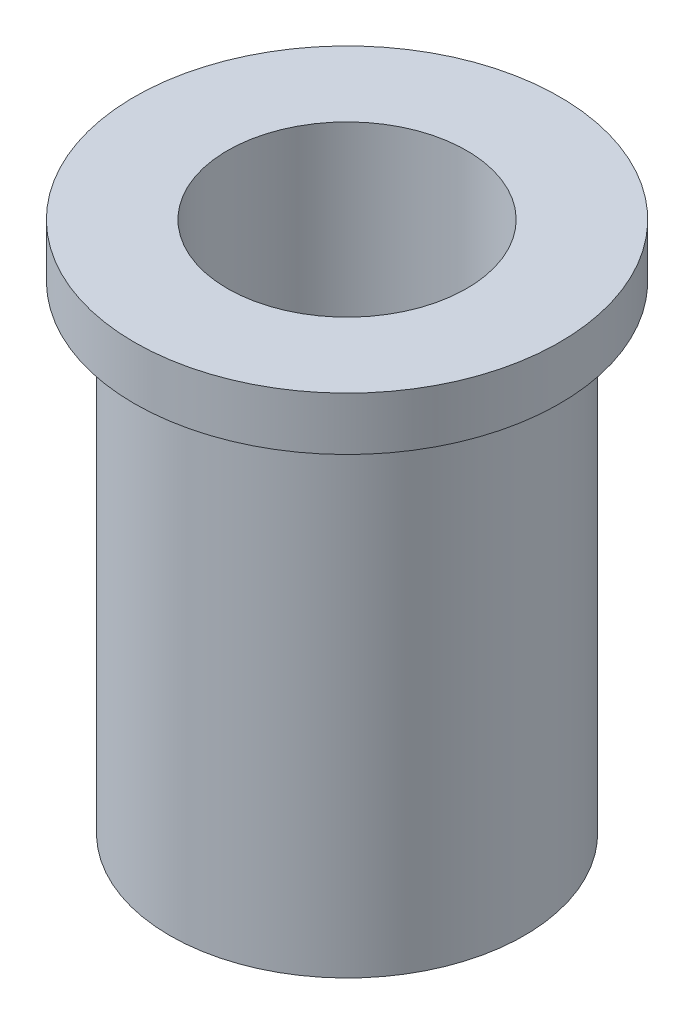
ISO-10303-21;
HEADER;
FILE_DESCRIPTION(('STEP AP214'),'2;1');
FILE_NAME('part.step','',(''),(''),'','','');
FILE_SCHEMA(('AUTOMOTIVE_DESIGN { 1 0 10303 214 1 1 1 1 }'));
ENDSEC;
DATA;
#1=APPLICATION_CONTEXT('core data for automotive mechanical design processes');
#2=APPLICATION_PROTOCOL_DEFINITION('international standard','automotive_design',2000,#1);
#3=PRODUCT_CONTEXT('',#1,'mechanical');
#4=PRODUCT('Part','Part','',(#3));
#5=PRODUCT_RELATED_PRODUCT_CATEGORY('part','',(#4));
#6=PRODUCT_DEFINITION_FORMATION('','',#4);
#7=PRODUCT_DEFINITION_CONTEXT('part definition',#1,'design');
#8=PRODUCT_DEFINITION('design','',#6,#7);
#9=PRODUCT_DEFINITION_SHAPE('','',#8);
#10=(LENGTH_UNIT() NAMED_UNIT(*) SI_UNIT(.MILLI.,.METRE.));
#11=(NAMED_UNIT(*) PLANE_ANGLE_UNIT() SI_UNIT($,.RADIAN.));
#12=(NAMED_UNIT(*) SI_UNIT($,.STERADIAN.) SOLID_ANGLE_UNIT());
#13=UNCERTAINTY_MEASURE_WITH_UNIT(LENGTH_MEASURE(1.E-05),#10,'distance_accuracy_value','');
#14=(GEOMETRIC_REPRESENTATION_CONTEXT(3) GLOBAL_UNCERTAINTY_ASSIGNED_CONTEXT((#13)) GLOBAL_UNIT_ASSIGNED_CONTEXT((#10,
#11,#12)) REPRESENTATION_CONTEXT('',''));
#15=CARTESIAN_POINT('',(0.,0.,0.));
#16=DIRECTION('',(0.,0.,1.));
#17=DIRECTION('',(1.,0.,0.));
#18=AXIS2_PLACEMENT_3D('',#15,#16,#17);
#19=CARTESIAN_POINT('',(0.,0.,0.));
#20=DIRECTION('',(0.,-1.,0.));
#21=DIRECTION('',(0.,0.,-1.));
#22=AXIS2_PLACEMENT_3D('',#19,#20,#21);
#23=PLANE('',#22);
#24=CARTESIAN_POINT('',(0.,0.,0.));
#25=DIRECTION('',(0.,1.,0.));
#26=DIRECTION('',(0.,0.,1.));
#27=AXIS2_PLACEMENT_3D('',#24,#25,#26);
#28=CIRCLE('',#27,3.375);
#29=CARTESIAN_POINT('',(0.,0.,3.37500000000001));
#30=VERTEX_POINT('',#29);
#31=EDGE_CURVE('E56',#30,#30,#28,.T.);
#32=ORIENTED_EDGE('',*,*,#31,.F.);
#33=EDGE_LOOP('',(#32));
#34=FACE_BOUND('',#33,.T.);
#35=CARTESIAN_POINT('',(0.,0.,0.));
#36=DIRECTION('',(0.,1.,0.));
#37=DIRECTION('',(0.,0.,1.));
#38=AXIS2_PLACEMENT_3D('',#35,#36,#37);
#39=CIRCLE('',#38,6.);
#40=CARTESIAN_POINT('',(0.,0.,6.00000000000002));
#41=VERTEX_POINT('',#40);
#42=EDGE_CURVE('E10',#41,#41,#39,.T.);
#43=ORIENTED_EDGE('',*,*,#42,.T.);
#44=EDGE_LOOP('',(#43));
#45=FACE_BOUND('',#44,.T.);
#46=ADVANCED_FACE('F34',(#34,#45),#23,.F.);
#47=CARTESIAN_POINT('',(0.,2.99999999999998,0.));
#48=DIRECTION('',(0.,1.,0.));
#49=DIRECTION('',(0.,0.,1.));
#50=AXIS2_PLACEMENT_3D('',#47,#48,#49);
#51=CYLINDRICAL_SURFACE('',#50,6.);
#52=ORIENTED_EDGE('',*,*,#42,.F.);
#53=EDGE_LOOP('',(#52));
#54=FACE_BOUND('',#53,.T.);
#55=CARTESIAN_POINT('',(0.,-1.5,0.));
#56=DIRECTION('',(0.,1.,0.));
#57=DIRECTION('',(0.,0.,1.));
#58=AXIS2_PLACEMENT_3D('',#55,#56,#57);
#59=CIRCLE('',#58,6.);
#60=CARTESIAN_POINT('',(0.,-1.5,6.00000000000002));
#61=VERTEX_POINT('',#60);
#62=EDGE_CURVE('E40',#61,#61,#59,.T.);
#63=ORIENTED_EDGE('',*,*,#62,.T.);
#64=EDGE_LOOP('',(#63));
#65=FACE_BOUND('',#64,.T.);
#66=ADVANCED_FACE('F63',(#54,#65),#51,.T.);
#67=CARTESIAN_POINT('',(6.00000000000008,-1.5,0.));
#68=DIRECTION('',(0.,1.,0.));
#69=DIRECTION('',(0.,0.,1.));
#70=AXIS2_PLACEMENT_3D('',#67,#68,#69);
#71=PLANE('',#70);
#72=ORIENTED_EDGE('',*,*,#62,.F.);
#73=EDGE_LOOP('',(#72));
#74=FACE_BOUND('',#73,.T.);
#75=CARTESIAN_POINT('',(0.,-1.5,0.));
#76=DIRECTION('',(0.,1.,0.));
#77=DIRECTION('',(0.,0.,1.));
#78=AXIS2_PLACEMENT_3D('',#75,#76,#77);
#79=CIRCLE('',#78,5.);
#80=CARTESIAN_POINT('',(0.,-1.5,5.00000000000002));
#81=VERTEX_POINT('',#80);
#82=EDGE_CURVE('E44',#81,#81,#79,.T.);
#83=ORIENTED_EDGE('',*,*,#82,.T.);
#84=EDGE_LOOP('',(#83));
#85=FACE_BOUND('',#84,.T.);
#86=ADVANCED_FACE('F67',(#74,#85),#71,.F.);
#87=CARTESIAN_POINT('',(0.,2.99999999999998,0.));
#88=DIRECTION('',(0.,1.,0.));
#89=DIRECTION('',(0.,0.,1.));
#90=AXIS2_PLACEMENT_3D('',#87,#88,#89);
#91=CYLINDRICAL_SURFACE('',#90,5.);
#92=ORIENTED_EDGE('',*,*,#82,.F.);
#93=EDGE_LOOP('',(#92));
#94=FACE_BOUND('',#93,.T.);
#95=CARTESIAN_POINT('',(0.,-15.,0.));
#96=DIRECTION('',(0.,1.,0.));
#97=DIRECTION('',(0.,0.,1.));
#98=AXIS2_PLACEMENT_3D('',#95,#96,#97);
#99=CIRCLE('',#98,5.);
#100=CARTESIAN_POINT('',(0.,-15.,5.00000000000002));
#101=VERTEX_POINT('',#100);
#102=EDGE_CURVE('E48',#101,#101,#99,.T.);
#103=ORIENTED_EDGE('',*,*,#102,.T.);
#104=EDGE_LOOP('',(#103));
#105=FACE_BOUND('',#104,.T.);
#106=ADVANCED_FACE('F72',(#94,#105),#91,.T.);
#107=CARTESIAN_POINT('',(5.00000000000003,-15.,0.));
#108=DIRECTION('',(0.,1.,0.));
#109=DIRECTION('',(0.,0.,1.));
#110=AXIS2_PLACEMENT_3D('',#107,#108,#109);
#111=PLANE('',#110);
#112=CARTESIAN_POINT('',(0.,-15.,0.));
#113=DIRECTION('',(0.,1.,0.));
#114=DIRECTION('',(0.,0.,1.));
#115=AXIS2_PLACEMENT_3D('',#112,#113,#114);
#116=CIRCLE('',#115,3.375);
#117=CARTESIAN_POINT('',(0.,-15.,3.37500000000001));
#118=VERTEX_POINT('',#117);
#119=EDGE_CURVE('E53',#118,#118,#116,.T.);
#120=ORIENTED_EDGE('',*,*,#119,.T.);
#121=EDGE_LOOP('',(#120));
#122=FACE_BOUND('',#121,.T.);
#123=ORIENTED_EDGE('',*,*,#102,.F.);
#124=EDGE_LOOP('',(#123));
#125=FACE_BOUND('',#124,.T.);
#126=ADVANCED_FACE('F78',(#122,#125),#111,.F.);
#127=CARTESIAN_POINT('',(0.,-15.,0.));
#128=DIRECTION('',(0.,1.,0.));
#129=DIRECTION('',(0.,0.,1.));
#130=AXIS2_PLACEMENT_3D('',#127,#128,#129);
#131=CYLINDRICAL_SURFACE('',#130,3.375);
#132=ORIENTED_EDGE('',*,*,#119,.F.);
#133=EDGE_LOOP('',(#132));
#134=FACE_BOUND('',#133,.T.);
#135=ORIENTED_EDGE('',*,*,#31,.T.);
#136=EDGE_LOOP('',(#135));
#137=FACE_BOUND('',#136,.T.);
#138=ADVANCED_FACE('F60',(#134,#137),#131,.F.);
#139=CLOSED_SHELL('',(#46,#66,#86,#106,#126,#138));
#140=MANIFOLD_SOLID_BREP('B2',#139);
#141=ADVANCED_BREP_SHAPE_REPRESENTATION('',(#18,#140),#14);
#142=SHAPE_DEFINITION_REPRESENTATION(#9,#141);
ENDSEC;
END-ISO-10303-21;
